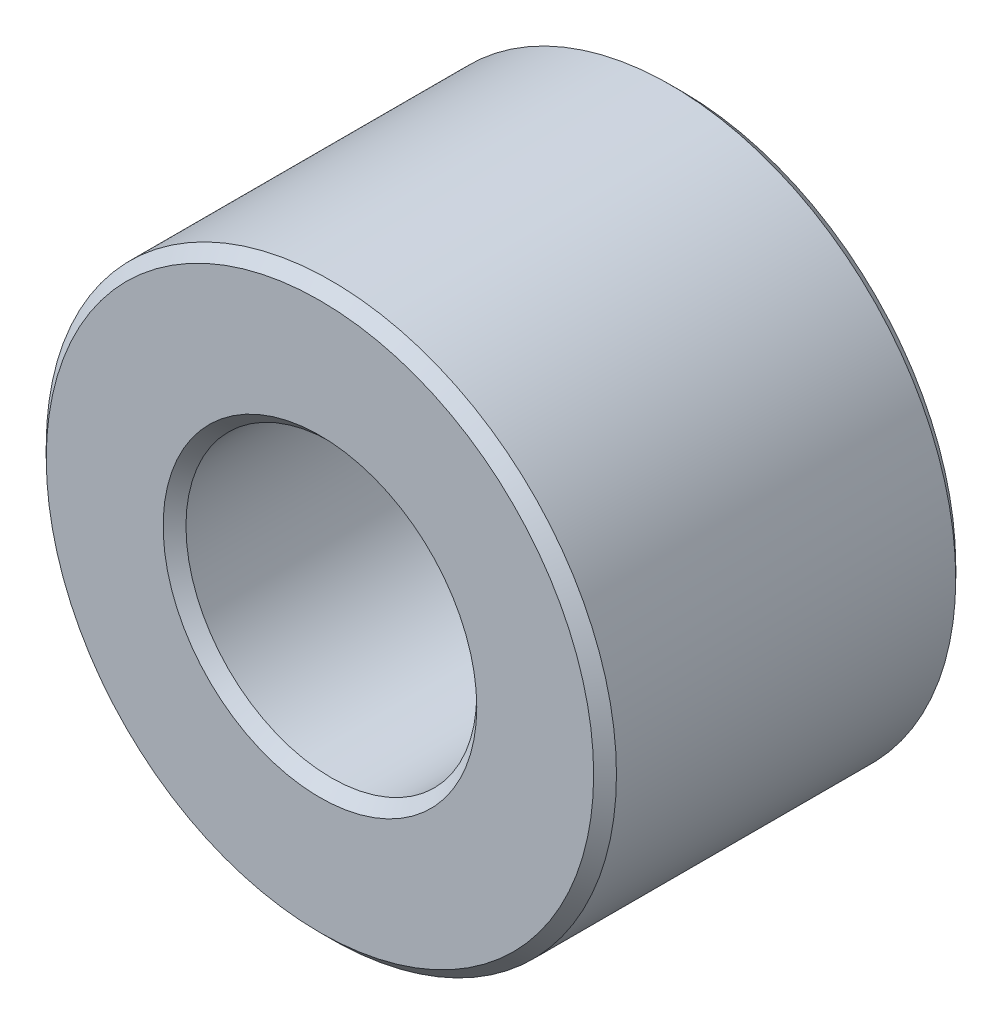
ISO-10303-21;
HEADER;
FILE_DESCRIPTION(('STEP AP214'),'2;1');
FILE_NAME('part.step','',(''),(''),'','','');
FILE_SCHEMA(('AUTOMOTIVE_DESIGN { 1 0 10303 214 1 1 1 1 }'));
ENDSEC;
DATA;
#1=APPLICATION_CONTEXT('core data for automotive mechanical design processes');
#2=APPLICATION_PROTOCOL_DEFINITION('international standard','automotive_design',2000,#1);
#3=PRODUCT_CONTEXT('',#1,'mechanical');
#4=PRODUCT('Part','Part','',(#3));
#5=PRODUCT_RELATED_PRODUCT_CATEGORY('part','',(#4));
#6=PRODUCT_DEFINITION_FORMATION('','',#4);
#7=PRODUCT_DEFINITION_CONTEXT('part definition',#1,'design');
#8=PRODUCT_DEFINITION('design','',#6,#7);
#9=PRODUCT_DEFINITION_SHAPE('','',#8);
#10=(LENGTH_UNIT() NAMED_UNIT(*) SI_UNIT(.MILLI.,.METRE.));
#11=(NAMED_UNIT(*) PLANE_ANGLE_UNIT() SI_UNIT($,.RADIAN.));
#12=(NAMED_UNIT(*) SI_UNIT($,.STERADIAN.) SOLID_ANGLE_UNIT());
#13=UNCERTAINTY_MEASURE_WITH_UNIT(LENGTH_MEASURE(1.E-05),#10,'distance_accuracy_value','');
#14=(GEOMETRIC_REPRESENTATION_CONTEXT(3) GLOBAL_UNCERTAINTY_ASSIGNED_CONTEXT((#13)) GLOBAL_UNIT_ASSIGNED_CONTEXT((#10,
#11,#12)) REPRESENTATION_CONTEXT('',''));
#15=CARTESIAN_POINT('',(0.,0.,0.));
#16=DIRECTION('',(0.,0.,1.));
#17=DIRECTION('',(1.,0.,0.));
#18=AXIS2_PLACEMENT_3D('',#15,#16,#17);
#19=CARTESIAN_POINT('',(0.,0.,6.35));
#20=DIRECTION('',(0.,0.,1.));
#21=DIRECTION('',(1.,0.,0.));
#22=AXIS2_PLACEMENT_3D('',#19,#20,#21);
#23=PLANE('',#22);
#24=CARTESIAN_POINT('',(0.,0.,6.35));
#25=DIRECTION('',(0.,0.,1.));
#26=DIRECTION('',(1.,0.,0.));
#27=AXIS2_PLACEMENT_3D('',#24,#25,#26);
#28=CIRCLE('',#27,2.75);
#29=CARTESIAN_POINT('',(2.75,0.,6.35));
#30=VERTEX_POINT('',#29);
#31=EDGE_CURVE('E10',#30,#30,#28,.F.);
#32=ORIENTED_EDGE('',*,*,#31,.T.);
#33=EDGE_LOOP('',(#32));
#34=FACE_BOUND('',#33,.T.);
#35=CARTESIAN_POINT('',(0.,0.,6.35));
#36=DIRECTION('',(0.,0.,1.));
#37=DIRECTION('',(1.,0.,0.));
#38=AXIS2_PLACEMENT_3D('',#35,#36,#37);
#39=CIRCLE('',#38,4.8);
#40=CARTESIAN_POINT('',(4.8,0.,6.35));
#41=VERTEX_POINT('',#40);
#42=EDGE_CURVE('E39',#41,#41,#39,.T.);
#43=ORIENTED_EDGE('',*,*,#42,.T.);
#44=EDGE_LOOP('',(#43));
#45=FACE_BOUND('',#44,.T.);
#46=ADVANCED_FACE('F32',(#34,#45),#23,.T.);
#47=CARTESIAN_POINT('',(0.,0.,0.));
#48=DIRECTION('',(0.,0.,1.));
#49=DIRECTION('',(1.,0.,0.));
#50=AXIS2_PLACEMENT_3D('',#47,#48,#49);
#51=PLANE('',#50);
#52=CARTESIAN_POINT('',(0.,0.,0.));
#53=DIRECTION('',(0.,0.,1.));
#54=DIRECTION('',(1.,0.,0.));
#55=AXIS2_PLACEMENT_3D('',#52,#53,#54);
#56=CIRCLE('',#55,4.8);
#57=CARTESIAN_POINT('',(4.8,0.,0.));
#58=VERTEX_POINT('',#57);
#59=EDGE_CURVE('E52',#58,#58,#56,.F.);
#60=ORIENTED_EDGE('',*,*,#59,.T.);
#61=EDGE_LOOP('',(#60));
#62=FACE_BOUND('',#61,.T.);
#63=CARTESIAN_POINT('',(0.,0.,0.));
#64=DIRECTION('',(0.,0.,1.));
#65=DIRECTION('',(1.,0.,0.));
#66=AXIS2_PLACEMENT_3D('',#63,#64,#65);
#67=CIRCLE('',#66,2.75);
#68=CARTESIAN_POINT('',(2.75,0.,0.));
#69=VERTEX_POINT('',#68);
#70=EDGE_CURVE('E55',#69,#69,#67,.T.);
#71=ORIENTED_EDGE('',*,*,#70,.T.);
#72=EDGE_LOOP('',(#71));
#73=FACE_BOUND('',#72,.T.);
#74=ADVANCED_FACE('F76',(#62,#73),#51,.F.);
#75=CARTESIAN_POINT('',(0.,0.,6.35));
#76=DIRECTION('',(0.,0.,-1.));
#77=DIRECTION('',(-1.,0.,0.));
#78=AXIS2_PLACEMENT_3D('',#75,#76,#77);
#79=CYLINDRICAL_SURFACE('',#78,5.);
#80=CARTESIAN_POINT('',(0.,0.,0.200000000000001));
#81=DIRECTION('',(0.,0.,1.));
#82=DIRECTION('',(1.,0.,0.));
#83=AXIS2_PLACEMENT_3D('',#80,#81,#82);
#84=CIRCLE('',#83,5.);
#85=CARTESIAN_POINT('',(5.,0.,0.200000000000001));
#86=VERTEX_POINT('',#85);
#87=EDGE_CURVE('E58',#86,#86,#84,.T.);
#88=ORIENTED_EDGE('',*,*,#87,.T.);
#89=EDGE_LOOP('',(#88));
#90=FACE_BOUND('',#89,.T.);
#91=CARTESIAN_POINT('',(0.,0.,6.15));
#92=DIRECTION('',(0.,0.,1.));
#93=DIRECTION('',(1.,0.,0.));
#94=AXIS2_PLACEMENT_3D('',#91,#92,#93);
#95=CIRCLE('',#94,5.);
#96=CARTESIAN_POINT('',(5.,0.,6.15));
#97=VERTEX_POINT('',#96);
#98=EDGE_CURVE('E61',#97,#97,#95,.F.);
#99=ORIENTED_EDGE('',*,*,#98,.T.);
#100=EDGE_LOOP('',(#99));
#101=FACE_BOUND('',#100,.T.);
#102=ADVANCED_FACE('F65',(#90,#101),#79,.T.);
#103=CARTESIAN_POINT('',(0.,0.,6.35));
#104=DIRECTION('',(0.,0.,-1.));
#105=DIRECTION('',(-1.,0.,0.));
#106=AXIS2_PLACEMENT_3D('',#103,#104,#105);
#107=CYLINDRICAL_SURFACE('',#106,2.55);
#108=CARTESIAN_POINT('',(0.,0.,0.200000000000001));
#109=DIRECTION('',(0.,0.,1.));
#110=DIRECTION('',(1.,0.,0.));
#111=AXIS2_PLACEMENT_3D('',#108,#109,#110);
#112=CIRCLE('',#111,2.55);
#113=CARTESIAN_POINT('',(2.55,0.,0.200000000000001));
#114=VERTEX_POINT('',#113);
#115=EDGE_CURVE('E43',#114,#114,#112,.F.);
#116=ORIENTED_EDGE('',*,*,#115,.T.);
#117=EDGE_LOOP('',(#116));
#118=FACE_BOUND('',#117,.T.);
#119=CARTESIAN_POINT('',(0.,0.,6.15));
#120=DIRECTION('',(0.,0.,1.));
#121=DIRECTION('',(1.,0.,0.));
#122=AXIS2_PLACEMENT_3D('',#119,#120,#121);
#123=CIRCLE('',#122,2.55);
#124=CARTESIAN_POINT('',(2.55,0.,6.15));
#125=VERTEX_POINT('',#124);
#126=EDGE_CURVE('E47',#125,#125,#123,.T.);
#127=ORIENTED_EDGE('',*,*,#126,.T.);
#128=EDGE_LOOP('',(#127));
#129=FACE_BOUND('',#128,.T.);
#130=ADVANCED_FACE('F84',(#118,#129),#107,.F.);
#131=CARTESIAN_POINT('',(0.,0.,0.200000000000001));
#132=DIRECTION('',(0.,0.,1.));
#133=DIRECTION('',(1.,0.,0.));
#134=AXIS2_PLACEMENT_3D('',#131,#132,#133);
#135=CONICAL_SURFACE('',#134,5.,0.785398163397448);
#136=ORIENTED_EDGE('',*,*,#59,.F.);
#137=EDGE_LOOP('',(#136));
#138=FACE_BOUND('',#137,.T.);
#139=ORIENTED_EDGE('',*,*,#87,.F.);
#140=EDGE_LOOP('',(#139));
#141=FACE_BOUND('',#140,.T.);
#142=ADVANCED_FACE('F89',(#138,#141),#135,.T.);
#143=CARTESIAN_POINT('',(0.,0.,0.));
#144=DIRECTION('',(0.,0.,-1.));
#145=DIRECTION('',(-1.,0.,0.));
#146=AXIS2_PLACEMENT_3D('',#143,#144,#145);
#147=CONICAL_SURFACE('',#146,2.75,0.785398163397447);
#148=ORIENTED_EDGE('',*,*,#115,.F.);
#149=EDGE_LOOP('',(#148));
#150=FACE_BOUND('',#149,.T.);
#151=ORIENTED_EDGE('',*,*,#70,.F.);
#152=EDGE_LOOP('',(#151));
#153=FACE_BOUND('',#152,.T.);
#154=ADVANCED_FACE('F73',(#150,#153),#147,.F.);
#155=CARTESIAN_POINT('',(0.,0.,6.15));
#156=DIRECTION('',(0.,0.,1.));
#157=DIRECTION('',(1.,0.,0.));
#158=AXIS2_PLACEMENT_3D('',#155,#156,#157);
#159=CONICAL_SURFACE('',#158,2.55,0.785398163397454);
#160=ORIENTED_EDGE('',*,*,#31,.F.);
#161=EDGE_LOOP('',(#160));
#162=FACE_BOUND('',#161,.T.);
#163=ORIENTED_EDGE('',*,*,#126,.F.);
#164=EDGE_LOOP('',(#163));
#165=FACE_BOUND('',#164,.T.);
#166=ADVANCED_FACE('F69',(#162,#165),#159,.F.);
#167=CARTESIAN_POINT('',(0.,0.,6.35));
#168=DIRECTION('',(0.,0.,-1.));
#169=DIRECTION('',(-1.,0.,0.));
#170=AXIS2_PLACEMENT_3D('',#167,#168,#169);
#171=CONICAL_SURFACE('',#170,4.8,0.785398163397444);
#172=ORIENTED_EDGE('',*,*,#98,.F.);
#173=EDGE_LOOP('',(#172));
#174=FACE_BOUND('',#173,.T.);
#175=ORIENTED_EDGE('',*,*,#42,.F.);
#176=EDGE_LOOP('',(#175));
#177=FACE_BOUND('',#176,.T.);
#178=ADVANCED_FACE('F34',(#174,#177),#171,.T.);
#179=CLOSED_SHELL('',(#46,#74,#102,#130,#142,#154,#166,#178));
#180=MANIFOLD_SOLID_BREP('B2',#179);
#181=ADVANCED_BREP_SHAPE_REPRESENTATION('',(#18,#180),#14);
#182=SHAPE_DEFINITION_REPRESENTATION(#9,#181);
ENDSEC;
END-ISO-10303-21;
